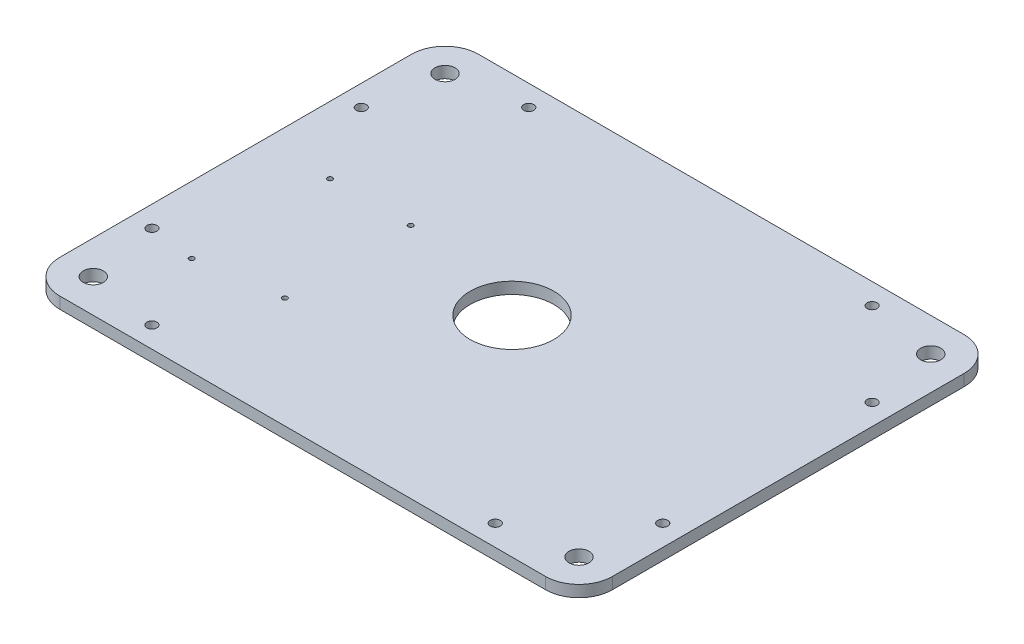
ISO-10303-21;
HEADER;
FILE_DESCRIPTION(('STEP AP214'),'2;1');
FILE_NAME('part.step','',(''),(''),'','','');
FILE_SCHEMA(('AUTOMOTIVE_DESIGN { 1 0 10303 214 1 1 1 1 }'));
ENDSEC;
DATA;
#1=APPLICATION_CONTEXT('core data for automotive mechanical design processes');
#2=APPLICATION_PROTOCOL_DEFINITION('international standard','automotive_design',2000,#1);
#3=PRODUCT_CONTEXT('',#1,'mechanical');
#4=PRODUCT('Part','Part','',(#3));
#5=PRODUCT_RELATED_PRODUCT_CATEGORY('part','',(#4));
#6=PRODUCT_DEFINITION_FORMATION('','',#4);
#7=PRODUCT_DEFINITION_CONTEXT('part definition',#1,'design');
#8=PRODUCT_DEFINITION('design','',#6,#7);
#9=PRODUCT_DEFINITION_SHAPE('','',#8);
#10=(LENGTH_UNIT() NAMED_UNIT(*) SI_UNIT(.MILLI.,.METRE.));
#11=(NAMED_UNIT(*) PLANE_ANGLE_UNIT() SI_UNIT($,.RADIAN.));
#12=(NAMED_UNIT(*) SI_UNIT($,.STERADIAN.) SOLID_ANGLE_UNIT());
#13=UNCERTAINTY_MEASURE_WITH_UNIT(LENGTH_MEASURE(1.E-05),#10,'distance_accuracy_value','');
#14=(GEOMETRIC_REPRESENTATION_CONTEXT(3) GLOBAL_UNCERTAINTY_ASSIGNED_CONTEXT((#13)) GLOBAL_UNIT_ASSIGNED_CONTEXT((#10,
#11,#12)) REPRESENTATION_CONTEXT('',''));
#15=CARTESIAN_POINT('',(0.,0.,0.));
#16=DIRECTION('',(0.,0.,1.));
#17=DIRECTION('',(1.,0.,0.));
#18=AXIS2_PLACEMENT_3D('',#15,#16,#17);
#19=CARTESIAN_POINT('',(-165.,6.9,125.));
#20=DIRECTION('',(1.,0.,0.));
#21=DIRECTION('',(0.,0.,-1.));
#22=AXIS2_PLACEMENT_3D('',#19,#20,#21);
#23=PLANE('',#22);
#24=DIRECTION('',(0.,0.,1.));
#25=VECTOR('',#24,1.);
#26=CARTESIAN_POINT('',(-165.,6.9,125.));
#27=LINE('',#26,#25);
#28=CARTESIAN_POINT('',(-165.,6.9,-105.));
#29=VERTEX_POINT('',#28);
#30=CARTESIAN_POINT('',(-165.,6.9,105.));
#31=VERTEX_POINT('',#30);
#32=EDGE_CURVE('E129',#29,#31,#27,.T.);
#33=ORIENTED_EDGE('',*,*,#32,.F.);
#34=DIRECTION('',(0.,-1.,0.));
#35=VECTOR('',#34,1.);
#36=CARTESIAN_POINT('',(-165.,6.9,-105.));
#37=LINE('',#36,#35);
#38=CARTESIAN_POINT('',(-165.,0.,-105.));
#39=VERTEX_POINT('',#38);
#40=EDGE_CURVE('E155',#29,#39,#37,.T.);
#41=ORIENTED_EDGE('',*,*,#40,.T.);
#42=DIRECTION('',(0.,0.,1.));
#43=VECTOR('',#42,1.);
#44=CARTESIAN_POINT('',(-165.,0.,125.));
#45=LINE('',#44,#43);
#46=CARTESIAN_POINT('',(-165.,0.,105.));
#47=VERTEX_POINT('',#46);
#48=EDGE_CURVE('E161',#39,#47,#45,.T.);
#49=ORIENTED_EDGE('',*,*,#48,.T.);
#50=DIRECTION('',(0.,-1.,0.));
#51=VECTOR('',#50,1.);
#52=CARTESIAN_POINT('',(-165.,6.9,105.));
#53=LINE('',#52,#51);
#54=EDGE_CURVE('E153',#47,#31,#53,.F.);
#55=ORIENTED_EDGE('',*,*,#54,.T.);
#56=EDGE_LOOP('',(#33,#41,#49,#55));
#57=FACE_BOUND('',#56,.T.);
#58=ADVANCED_FACE('F37',(#57),#23,.F.);
#59=CARTESIAN_POINT('',(-165.,6.9,125.));
#60=DIRECTION('',(0.,0.,-1.));
#61=DIRECTION('',(-1.,0.,0.));
#62=AXIS2_PLACEMENT_3D('',#59,#60,#61);
#63=PLANE('',#62);
#64=DIRECTION('',(1.,0.,0.));
#65=VECTOR('',#64,1.);
#66=CARTESIAN_POINT('',(-165.,6.9,125.));
#67=LINE('',#66,#65);
#68=CARTESIAN_POINT('',(-145.,6.9,125.));
#69=VERTEX_POINT('',#68);
#70=CARTESIAN_POINT('',(145.,6.9,125.));
#71=VERTEX_POINT('',#70);
#72=EDGE_CURVE('E132',#69,#71,#67,.T.);
#73=ORIENTED_EDGE('',*,*,#72,.F.);
#74=DIRECTION('',(0.,-1.,0.));
#75=VECTOR('',#74,1.);
#76=CARTESIAN_POINT('',(-145.,6.9,125.));
#77=LINE('',#76,#75);
#78=CARTESIAN_POINT('',(-145.,0.,125.));
#79=VERTEX_POINT('',#78);
#80=EDGE_CURVE('E11',#69,#79,#77,.T.);
#81=ORIENTED_EDGE('',*,*,#80,.T.);
#82=DIRECTION('',(1.,0.,0.));
#83=VECTOR('',#82,1.);
#84=CARTESIAN_POINT('',(-165.,0.,125.));
#85=LINE('',#84,#83);
#86=CARTESIAN_POINT('',(145.,0.,125.));
#87=VERTEX_POINT('',#86);
#88=EDGE_CURVE('E134',#79,#87,#85,.T.);
#89=ORIENTED_EDGE('',*,*,#88,.T.);
#90=DIRECTION('',(0.,-1.,0.));
#91=VECTOR('',#90,1.);
#92=CARTESIAN_POINT('',(145.,6.9,125.));
#93=LINE('',#92,#91);
#94=EDGE_CURVE('E45',#87,#71,#93,.F.);
#95=ORIENTED_EDGE('',*,*,#94,.T.);
#96=EDGE_LOOP('',(#73,#81,#89,#95));
#97=FACE_BOUND('',#96,.T.);
#98=ADVANCED_FACE('F324',(#97),#63,.F.);
#99=CARTESIAN_POINT('',(165.,6.9,125.));
#100=DIRECTION('',(-1.,0.,0.));
#101=DIRECTION('',(0.,0.,1.));
#102=AXIS2_PLACEMENT_3D('',#99,#100,#101);
#103=PLANE('',#102);
#104=DIRECTION('',(0.,0.,-1.));
#105=VECTOR('',#104,1.);
#106=CARTESIAN_POINT('',(165.,0.,125.));
#107=LINE('',#106,#105);
#108=CARTESIAN_POINT('',(165.,0.,105.));
#109=VERTEX_POINT('',#108);
#110=CARTESIAN_POINT('',(165.,0.,-105.));
#111=VERTEX_POINT('',#110);
#112=EDGE_CURVE('E130',#109,#111,#107,.T.);
#113=ORIENTED_EDGE('',*,*,#112,.T.);
#114=DIRECTION('',(0.,-1.,0.));
#115=VECTOR('',#114,1.);
#116=CARTESIAN_POINT('',(165.,6.9,-105.));
#117=LINE('',#116,#115);
#118=CARTESIAN_POINT('',(165.,6.9,-105.));
#119=VERTEX_POINT('',#118);
#120=EDGE_CURVE('E108',#111,#119,#117,.F.);
#121=ORIENTED_EDGE('',*,*,#120,.T.);
#122=DIRECTION('',(0.,0.,-1.));
#123=VECTOR('',#122,1.);
#124=CARTESIAN_POINT('',(165.,6.9,125.));
#125=LINE('',#124,#123);
#126=CARTESIAN_POINT('',(165.,6.9,105.));
#127=VERTEX_POINT('',#126);
#128=EDGE_CURVE('E173',#127,#119,#125,.T.);
#129=ORIENTED_EDGE('',*,*,#128,.F.);
#130=DIRECTION('',(0.,-1.,0.));
#131=VECTOR('',#130,1.);
#132=CARTESIAN_POINT('',(165.,6.9,105.));
#133=LINE('',#132,#131);
#134=EDGE_CURVE('E113',#127,#109,#133,.T.);
#135=ORIENTED_EDGE('',*,*,#134,.T.);
#136=EDGE_LOOP('',(#113,#121,#129,#135));
#137=FACE_BOUND('',#136,.T.);
#138=ADVANCED_FACE('F322',(#137),#103,.F.);
#139=CARTESIAN_POINT('',(-165.,6.9,-125.));
#140=DIRECTION('',(0.,0.,1.));
#141=DIRECTION('',(1.,0.,0.));
#142=AXIS2_PLACEMENT_3D('',#139,#140,#141);
#143=PLANE('',#142);
#144=DIRECTION('',(-1.,0.,0.));
#145=VECTOR('',#144,1.);
#146=CARTESIAN_POINT('',(-165.,6.9,-125.));
#147=LINE('',#146,#145);
#148=CARTESIAN_POINT('',(145.,6.9,-125.));
#149=VERTEX_POINT('',#148);
#150=CARTESIAN_POINT('',(-145.,6.9,-125.));
#151=VERTEX_POINT('',#150);
#152=EDGE_CURVE('E123',#149,#151,#147,.T.);
#153=ORIENTED_EDGE('',*,*,#152,.F.);
#154=DIRECTION('',(0.,-1.,0.));
#155=VECTOR('',#154,1.);
#156=CARTESIAN_POINT('',(145.,6.9,-125.));
#157=LINE('',#156,#155);
#158=CARTESIAN_POINT('',(145.,0.,-125.));
#159=VERTEX_POINT('',#158);
#160=EDGE_CURVE('E107',#149,#159,#157,.T.);
#161=ORIENTED_EDGE('',*,*,#160,.T.);
#162=DIRECTION('',(-1.,0.,0.));
#163=VECTOR('',#162,1.);
#164=CARTESIAN_POINT('',(-165.,0.,-125.));
#165=LINE('',#164,#163);
#166=CARTESIAN_POINT('',(-145.,0.,-125.));
#167=VERTEX_POINT('',#166);
#168=EDGE_CURVE('E120',#159,#167,#165,.T.);
#169=ORIENTED_EDGE('',*,*,#168,.T.);
#170=DIRECTION('',(0.,-1.,0.));
#171=VECTOR('',#170,1.);
#172=CARTESIAN_POINT('',(-145.,6.9,-125.));
#173=LINE('',#172,#171);
#174=EDGE_CURVE('E125',#167,#151,#173,.F.);
#175=ORIENTED_EDGE('',*,*,#174,.T.);
#176=EDGE_LOOP('',(#153,#161,#169,#175));
#177=FACE_BOUND('',#176,.T.);
#178=ADVANCED_FACE('F119',(#177),#143,.F.);
#179=CARTESIAN_POINT('',(0.,6.9,0.));
#180=DIRECTION('',(0.,-1.,0.));
#181=DIRECTION('',(0.,0.,-1.));
#182=AXIS2_PLACEMENT_3D('',#179,#180,#181);
#183=PLANE('',#182);
#184=CARTESIAN_POINT('',(-76.74,6.9,-16.275));
#185=DIRECTION('',(0.,1.,0.));
#186=DIRECTION('',(0.,0.,1.));
#187=AXIS2_PLACEMENT_3D('',#184,#185,#186);
#188=CIRCLE('',#187,1.5);
#189=CARTESIAN_POINT('',(-76.74,6.9,-14.775));
#190=VERTEX_POINT('',#189);
#191=EDGE_CURVE('E265',#190,#190,#188,.T.);
#192=ORIENTED_EDGE('',*,*,#191,.F.);
#193=EDGE_LOOP('',(#192));
#194=FACE_BOUND('',#193,.T.);
#195=CARTESIAN_POINT('',(-125.,6.9,66.275));
#196=DIRECTION('',(0.,1.,0.));
#197=DIRECTION('',(0.,0.,1.));
#198=AXIS2_PLACEMENT_3D('',#195,#196,#197);
#199=CIRCLE('',#198,1.5);
#200=CARTESIAN_POINT('',(-125.,6.9,67.775));
#201=VERTEX_POINT('',#200);
#202=EDGE_CURVE('E258',#201,#201,#199,.T.);
#203=ORIENTED_EDGE('',*,*,#202,.F.);
#204=EDGE_LOOP('',(#203));
#205=FACE_BOUND('',#204,.T.);
#206=CARTESIAN_POINT('',(-76.74,6.9,58.909));
#207=DIRECTION('',(0.,1.,0.));
#208=DIRECTION('',(0.,0.,1.));
#209=AXIS2_PLACEMENT_3D('',#206,#207,#208);
#210=CIRCLE('',#209,1.5);
#211=CARTESIAN_POINT('',(-76.74,6.9,60.409));
#212=VERTEX_POINT('',#211);
#213=EDGE_CURVE('E270',#212,#212,#210,.T.);
#214=ORIENTED_EDGE('',*,*,#213,.F.);
#215=EDGE_LOOP('',(#214));
#216=FACE_BOUND('',#215,.T.);
#217=CARTESIAN_POINT('',(-125.,6.9,-16.275));
#218=DIRECTION('',(0.,1.,0.));
#219=DIRECTION('',(0.,0.,1.));
#220=AXIS2_PLACEMENT_3D('',#217,#218,#219);
#221=CIRCLE('',#220,1.5);
#222=CARTESIAN_POINT('',(-125.,6.9,-14.775));
#223=VERTEX_POINT('',#222);
#224=EDGE_CURVE('E252',#223,#223,#221,.T.);
#225=ORIENTED_EDGE('',*,*,#224,.F.);
#226=EDGE_LOOP('',(#225));
#227=FACE_BOUND('',#226,.T.);
#228=CARTESIAN_POINT('',(152.5,6.9,-62.5));
#229=DIRECTION('',(0.,1.,0.));
#230=DIRECTION('',(0.,0.,1.));
#231=AXIS2_PLACEMENT_3D('',#228,#229,#230);
#232=CIRCLE('',#231,2.99999999999999);
#233=CARTESIAN_POINT('',(152.5,6.9,-59.5));
#234=VERTEX_POINT('',#233);
#235=EDGE_CURVE('E222',#234,#234,#232,.T.);
#236=ORIENTED_EDGE('',*,*,#235,.F.);
#237=EDGE_LOOP('',(#236));
#238=FACE_BOUND('',#237,.T.);
#239=CARTESIAN_POINT('',(-152.5,6.9,-62.5));
#240=DIRECTION('',(0.,1.,0.));
#241=DIRECTION('',(0.,0.,-1.));
#242=AXIS2_PLACEMENT_3D('',#239,#240,#241);
#243=CIRCLE('',#242,2.99999999999999);
#244=CARTESIAN_POINT('',(-152.5,6.9,-65.4999999999999));
#245=VERTEX_POINT('',#244);
#246=EDGE_CURVE('E229',#245,#245,#243,.T.);
#247=ORIENTED_EDGE('',*,*,#246,.F.);
#248=EDGE_LOOP('',(#247));
#249=FACE_BOUND('',#248,.T.);
#250=CARTESIAN_POINT('',(-102.5,6.9,-112.5));
#251=DIRECTION('',(0.,1.,0.));
#252=DIRECTION('',(0.,0.,-1.));
#253=AXIS2_PLACEMENT_3D('',#250,#251,#252);
#254=CIRCLE('',#253,3.00000000000001);
#255=CARTESIAN_POINT('',(-102.5,6.9,-115.5));
#256=VERTEX_POINT('',#255);
#257=EDGE_CURVE('E210',#256,#256,#254,.T.);
#258=ORIENTED_EDGE('',*,*,#257,.F.);
#259=EDGE_LOOP('',(#258));
#260=FACE_BOUND('',#259,.T.);
#261=CARTESIAN_POINT('',(-102.5,6.9,112.5));
#262=DIRECTION('',(0.,1.,0.));
#263=DIRECTION('',(0.,0.,1.));
#264=AXIS2_PLACEMENT_3D('',#261,#262,#263);
#265=CIRCLE('',#264,3.00000000000001);
#266=CARTESIAN_POINT('',(-102.5,6.9,115.5));
#267=VERTEX_POINT('',#266);
#268=EDGE_CURVE('E217',#267,#267,#265,.T.);
#269=ORIENTED_EDGE('',*,*,#268,.F.);
#270=EDGE_LOOP('',(#269));
#271=FACE_BOUND('',#270,.T.);
#272=CARTESIAN_POINT('',(102.5,6.9,-112.5));
#273=DIRECTION('',(0.,1.,0.));
#274=DIRECTION('',(0.,0.,1.));
#275=AXIS2_PLACEMENT_3D('',#272,#273,#274);
#276=CIRCLE('',#275,3.00000000000001);
#277=CARTESIAN_POINT('',(102.5,6.9,-109.5));
#278=VERTEX_POINT('',#277);
#279=EDGE_CURVE('E247',#278,#278,#276,.T.);
#280=ORIENTED_EDGE('',*,*,#279,.F.);
#281=EDGE_LOOP('',(#280));
#282=FACE_BOUND('',#281,.T.);
#283=CARTESIAN_POINT('',(102.5,6.9,112.5));
#284=DIRECTION('',(0.,1.,0.));
#285=DIRECTION('',(0.,0.,-1.));
#286=AXIS2_PLACEMENT_3D('',#283,#284,#285);
#287=CIRCLE('',#286,3.00000000000001);
#288=CARTESIAN_POINT('',(102.5,6.9,109.5));
#289=VERTEX_POINT('',#288);
#290=EDGE_CURVE('E241',#289,#289,#287,.T.);
#291=ORIENTED_EDGE('',*,*,#290,.F.);
#292=EDGE_LOOP('',(#291));
#293=FACE_BOUND('',#292,.T.);
#294=CARTESIAN_POINT('',(152.5,6.9,62.5));
#295=DIRECTION('',(0.,1.,0.));
#296=DIRECTION('',(0.,0.,-1.));
#297=AXIS2_PLACEMENT_3D('',#294,#295,#296);
#298=CIRCLE('',#297,2.99999999999999);
#299=CARTESIAN_POINT('',(152.5,6.9,59.5));
#300=VERTEX_POINT('',#299);
#301=EDGE_CURVE('E234',#300,#300,#298,.T.);
#302=ORIENTED_EDGE('',*,*,#301,.F.);
#303=EDGE_LOOP('',(#302));
#304=FACE_BOUND('',#303,.T.);
#305=CARTESIAN_POINT('',(-152.5,6.9,62.5));
#306=DIRECTION('',(0.,1.,0.));
#307=DIRECTION('',(0.,0.,1.));
#308=AXIS2_PLACEMENT_3D('',#305,#306,#307);
#309=CIRCLE('',#308,2.99999999999999);
#310=CARTESIAN_POINT('',(-152.5,6.9,65.4999999999999));
#311=VERTEX_POINT('',#310);
#312=EDGE_CURVE('E204',#311,#311,#309,.T.);
#313=ORIENTED_EDGE('',*,*,#312,.F.);
#314=EDGE_LOOP('',(#313));
#315=FACE_BOUND('',#314,.T.);
#316=CARTESIAN_POINT('',(0.,6.9,0.));
#317=DIRECTION('',(0.,1.,0.));
#318=DIRECTION('',(0.,0.,1.));
#319=AXIS2_PLACEMENT_3D('',#316,#317,#318);
#320=CIRCLE('',#319,25.);
#321=CARTESIAN_POINT('',(0.,6.9,25.));
#322=VERTEX_POINT('',#321);
#323=EDGE_CURVE('E198',#322,#322,#320,.T.);
#324=ORIENTED_EDGE('',*,*,#323,.F.);
#325=EDGE_LOOP('',(#324));
#326=FACE_BOUND('',#325,.T.);
#327=CARTESIAN_POINT('',(-145.,6.9,105.));
#328=DIRECTION('',(0.,1.,0.));
#329=DIRECTION('',(0.,0.,1.));
#330=AXIS2_PLACEMENT_3D('',#327,#328,#329);
#331=CIRCLE('',#330,6.00000000000002);
#332=CARTESIAN_POINT('',(-145.,6.9,111.));
#333=VERTEX_POINT('',#332);
#334=EDGE_CURVE('E180',#333,#333,#331,.T.);
#335=ORIENTED_EDGE('',*,*,#334,.F.);
#336=EDGE_LOOP('',(#335));
#337=FACE_BOUND('',#336,.T.);
#338=CARTESIAN_POINT('',(145.,6.9,105.));
#339=DIRECTION('',(0.,1.,0.));
#340=DIRECTION('',(0.,0.,1.));
#341=AXIS2_PLACEMENT_3D('',#338,#339,#340);
#342=CIRCLE('',#341,6.00000000000002);
#343=CARTESIAN_POINT('',(145.,6.9,111.));
#344=VERTEX_POINT('',#343);
#345=EDGE_CURVE('E187',#344,#344,#342,.T.);
#346=ORIENTED_EDGE('',*,*,#345,.F.);
#347=EDGE_LOOP('',(#346));
#348=FACE_BOUND('',#347,.T.);
#349=CARTESIAN_POINT('',(145.,6.9,-105.));
#350=DIRECTION('',(0.,1.,0.));
#351=DIRECTION('',(0.,0.,1.));
#352=AXIS2_PLACEMENT_3D('',#349,#350,#351);
#353=CIRCLE('',#352,6.00000000000002);
#354=CARTESIAN_POINT('',(145.,6.9,-99.));
#355=VERTEX_POINT('',#354);
#356=EDGE_CURVE('E193',#355,#355,#353,.T.);
#357=ORIENTED_EDGE('',*,*,#356,.F.);
#358=EDGE_LOOP('',(#357));
#359=FACE_BOUND('',#358,.T.);
#360=CARTESIAN_POINT('',(-145.,6.9,-105.));
#361=DIRECTION('',(0.,1.,0.));
#362=DIRECTION('',(0.,0.,1.));
#363=AXIS2_PLACEMENT_3D('',#360,#361,#362);
#364=CIRCLE('',#363,6.00000000000002);
#365=CARTESIAN_POINT('',(-145.,6.9,-99.));
#366=VERTEX_POINT('',#365);
#367=EDGE_CURVE('E169',#366,#366,#364,.T.);
#368=ORIENTED_EDGE('',*,*,#367,.F.);
#369=EDGE_LOOP('',(#368));
#370=FACE_BOUND('',#369,.T.);
#371=ORIENTED_EDGE('',*,*,#128,.T.);
#372=CARTESIAN_POINT('',(145.,6.9,-105.));
#373=DIRECTION('',(0.,-1.,0.));
#374=DIRECTION('',(0.,0.,-1.));
#375=AXIS2_PLACEMENT_3D('',#372,#373,#374);
#376=CIRCLE('',#375,20.);
#377=EDGE_CURVE('E151',#119,#149,#376,.F.);
#378=ORIENTED_EDGE('',*,*,#377,.T.);
#379=ORIENTED_EDGE('',*,*,#152,.T.);
#380=CARTESIAN_POINT('',(-145.,6.9,-105.));
#381=DIRECTION('',(0.,-1.,0.));
#382=DIRECTION('',(0.,0.,-1.));
#383=AXIS2_PLACEMENT_3D('',#380,#381,#382);
#384=CIRCLE('',#383,20.);
#385=EDGE_CURVE('E149',#151,#29,#384,.F.);
#386=ORIENTED_EDGE('',*,*,#385,.T.);
#387=ORIENTED_EDGE('',*,*,#32,.T.);
#388=CARTESIAN_POINT('',(-145.,6.9,105.));
#389=DIRECTION('',(0.,-1.,0.));
#390=DIRECTION('',(0.,0.,-1.));
#391=AXIS2_PLACEMENT_3D('',#388,#389,#390);
#392=CIRCLE('',#391,20.);
#393=EDGE_CURVE('E58',#31,#69,#392,.F.);
#394=ORIENTED_EDGE('',*,*,#393,.T.);
#395=ORIENTED_EDGE('',*,*,#72,.T.);
#396=CARTESIAN_POINT('',(145.,6.9,105.));
#397=DIRECTION('',(0.,-1.,0.));
#398=DIRECTION('',(0.,0.,-1.));
#399=AXIS2_PLACEMENT_3D('',#396,#397,#398);
#400=CIRCLE('',#399,20.);
#401=EDGE_CURVE('E146',#71,#127,#400,.F.);
#402=ORIENTED_EDGE('',*,*,#401,.T.);
#403=EDGE_LOOP('',(#371,#378,#379,#386,#387,#394,#395,#402));
#404=FACE_BOUND('',#403,.T.);
#405=ADVANCED_FACE('F286',(#194,#205,#216,#227,#238,#249,#260,#271,#282,#293,#304,#315,#326,
#337,#348,#359,#370,#404),#183,.F.);
#406=CARTESIAN_POINT('',(0.,0.,0.));
#407=DIRECTION('',(0.,-1.,0.));
#408=DIRECTION('',(0.,0.,-1.));
#409=AXIS2_PLACEMENT_3D('',#406,#407,#408);
#410=PLANE('',#409);
#411=CARTESIAN_POINT('',(-76.74,0.,-16.275));
#412=DIRECTION('',(0.,1.,0.));
#413=DIRECTION('',(0.,0.,1.));
#414=AXIS2_PLACEMENT_3D('',#411,#412,#413);
#415=CIRCLE('',#414,1.5);
#416=CARTESIAN_POINT('',(-76.74,0.,-14.775));
#417=VERTEX_POINT('',#416);
#418=EDGE_CURVE('E255',#417,#417,#415,.T.);
#419=ORIENTED_EDGE('',*,*,#418,.T.);
#420=EDGE_LOOP('',(#419));
#421=FACE_BOUND('',#420,.T.);
#422=CARTESIAN_POINT('',(-125.,0.,66.275));
#423=DIRECTION('',(0.,1.,0.));
#424=DIRECTION('',(0.,0.,1.));
#425=AXIS2_PLACEMENT_3D('',#422,#423,#424);
#426=CIRCLE('',#425,1.5);
#427=CARTESIAN_POINT('',(-125.,0.,67.775));
#428=VERTEX_POINT('',#427);
#429=EDGE_CURVE('E261',#428,#428,#426,.T.);
#430=ORIENTED_EDGE('',*,*,#429,.T.);
#431=EDGE_LOOP('',(#430));
#432=FACE_BOUND('',#431,.T.);
#433=CARTESIAN_POINT('',(-76.74,0.,58.909));
#434=DIRECTION('',(0.,1.,0.));
#435=DIRECTION('',(0.,0.,1.));
#436=AXIS2_PLACEMENT_3D('',#433,#434,#435);
#437=CIRCLE('',#436,1.5);
#438=CARTESIAN_POINT('',(-76.74,0.,60.409));
#439=VERTEX_POINT('',#438);
#440=EDGE_CURVE('E262',#439,#439,#437,.T.);
#441=ORIENTED_EDGE('',*,*,#440,.T.);
#442=EDGE_LOOP('',(#441));
#443=FACE_BOUND('',#442,.T.);
#444=CARTESIAN_POINT('',(-125.,0.,-16.275));
#445=DIRECTION('',(0.,1.,0.));
#446=DIRECTION('',(0.,0.,1.));
#447=AXIS2_PLACEMENT_3D('',#444,#445,#446);
#448=CIRCLE('',#447,1.5);
#449=CARTESIAN_POINT('',(-125.,0.,-14.775));
#450=VERTEX_POINT('',#449);
#451=EDGE_CURVE('E238',#450,#450,#448,.T.);
#452=ORIENTED_EDGE('',*,*,#451,.T.);
#453=EDGE_LOOP('',(#452));
#454=FACE_BOUND('',#453,.T.);
#455=CARTESIAN_POINT('',(152.5,0.,-62.5));
#456=DIRECTION('',(0.,1.,0.));
#457=DIRECTION('',(0.,0.,1.));
#458=AXIS2_PLACEMENT_3D('',#455,#456,#457);
#459=CIRCLE('',#458,2.99999999999999);
#460=CARTESIAN_POINT('',(152.5,0.,-59.5));
#461=VERTEX_POINT('',#460);
#462=EDGE_CURVE('E225',#461,#461,#459,.T.);
#463=ORIENTED_EDGE('',*,*,#462,.T.);
#464=EDGE_LOOP('',(#463));
#465=FACE_BOUND('',#464,.T.);
#466=CARTESIAN_POINT('',(-152.5,0.,-62.5));
#467=DIRECTION('',(0.,1.,0.));
#468=DIRECTION('',(0.,0.,-1.));
#469=AXIS2_PLACEMENT_3D('',#466,#467,#468);
#470=CIRCLE('',#469,2.99999999999999);
#471=CARTESIAN_POINT('',(-152.5,0.,-65.4999999999999));
#472=VERTEX_POINT('',#471);
#473=EDGE_CURVE('E214',#472,#472,#470,.T.);
#474=ORIENTED_EDGE('',*,*,#473,.T.);
#475=EDGE_LOOP('',(#474));
#476=FACE_BOUND('',#475,.T.);
#477=CARTESIAN_POINT('',(-102.5,0.,-112.5));
#478=DIRECTION('',(0.,1.,0.));
#479=DIRECTION('',(0.,0.,-1.));
#480=AXIS2_PLACEMENT_3D('',#477,#478,#479);
#481=CIRCLE('',#480,3.00000000000001);
#482=CARTESIAN_POINT('',(-102.5,0.,-115.5));
#483=VERTEX_POINT('',#482);
#484=EDGE_CURVE('E213',#483,#483,#481,.T.);
#485=ORIENTED_EDGE('',*,*,#484,.T.);
#486=EDGE_LOOP('',(#485));
#487=FACE_BOUND('',#486,.T.);
#488=CARTESIAN_POINT('',(-102.5,0.,112.5));
#489=DIRECTION('',(0.,1.,0.));
#490=DIRECTION('',(0.,0.,1.));
#491=AXIS2_PLACEMENT_3D('',#488,#489,#490);
#492=CIRCLE('',#491,3.00000000000001);
#493=CARTESIAN_POINT('',(-102.5,0.,115.5));
#494=VERTEX_POINT('',#493);
#495=EDGE_CURVE('E207',#494,#494,#492,.T.);
#496=ORIENTED_EDGE('',*,*,#495,.T.);
#497=EDGE_LOOP('',(#496));
#498=FACE_BOUND('',#497,.T.);
#499=CARTESIAN_POINT('',(102.5,0.,-112.5));
#500=DIRECTION('',(0.,1.,0.));
#501=DIRECTION('',(0.,0.,1.));
#502=AXIS2_PLACEMENT_3D('',#499,#500,#501);
#503=CIRCLE('',#502,3.00000000000001);
#504=CARTESIAN_POINT('',(102.5,0.,-109.5));
#505=VERTEX_POINT('',#504);
#506=EDGE_CURVE('E226',#505,#505,#503,.T.);
#507=ORIENTED_EDGE('',*,*,#506,.T.);
#508=EDGE_LOOP('',(#507));
#509=FACE_BOUND('',#508,.T.);
#510=CARTESIAN_POINT('',(102.5,0.,112.5));
#511=DIRECTION('',(0.,1.,0.));
#512=DIRECTION('',(0.,0.,-1.));
#513=AXIS2_PLACEMENT_3D('',#510,#511,#512);
#514=CIRCLE('',#513,3.00000000000001);
#515=CARTESIAN_POINT('',(102.5,0.,109.5));
#516=VERTEX_POINT('',#515);
#517=EDGE_CURVE('E244',#516,#516,#514,.T.);
#518=ORIENTED_EDGE('',*,*,#517,.T.);
#519=EDGE_LOOP('',(#518));
#520=FACE_BOUND('',#519,.T.);
#521=CARTESIAN_POINT('',(152.5,0.,62.5));
#522=DIRECTION('',(0.,1.,0.));
#523=DIRECTION('',(0.,0.,-1.));
#524=AXIS2_PLACEMENT_3D('',#521,#522,#523);
#525=CIRCLE('',#524,2.99999999999999);
#526=CARTESIAN_POINT('',(152.5,0.,59.5));
#527=VERTEX_POINT('',#526);
#528=EDGE_CURVE('E237',#527,#527,#525,.T.);
#529=ORIENTED_EDGE('',*,*,#528,.T.);
#530=EDGE_LOOP('',(#529));
#531=FACE_BOUND('',#530,.T.);
#532=CARTESIAN_POINT('',(-152.5,0.,62.5));
#533=DIRECTION('',(0.,1.,0.));
#534=DIRECTION('',(0.,0.,1.));
#535=AXIS2_PLACEMENT_3D('',#532,#533,#534);
#536=CIRCLE('',#535,2.99999999999999);
#537=CARTESIAN_POINT('',(-152.5,0.,65.4999999999999));
#538=VERTEX_POINT('',#537);
#539=EDGE_CURVE('E201',#538,#538,#536,.T.);
#540=ORIENTED_EDGE('',*,*,#539,.T.);
#541=EDGE_LOOP('',(#540));
#542=FACE_BOUND('',#541,.T.);
#543=CARTESIAN_POINT('',(0.,0.,0.));
#544=DIRECTION('',(0.,1.,0.));
#545=DIRECTION('',(0.,0.,1.));
#546=AXIS2_PLACEMENT_3D('',#543,#544,#545);
#547=CIRCLE('',#546,25.);
#548=CARTESIAN_POINT('',(0.,0.,25.));
#549=VERTEX_POINT('',#548);
#550=EDGE_CURVE('E184',#549,#549,#547,.T.);
#551=ORIENTED_EDGE('',*,*,#550,.T.);
#552=EDGE_LOOP('',(#551));
#553=FACE_BOUND('',#552,.T.);
#554=CARTESIAN_POINT('',(-145.,0.,105.));
#555=DIRECTION('',(0.,1.,0.));
#556=DIRECTION('',(0.,0.,1.));
#557=AXIS2_PLACEMENT_3D('',#554,#555,#556);
#558=CIRCLE('',#557,6.00000000000002);
#559=CARTESIAN_POINT('',(-145.,0.,111.));
#560=VERTEX_POINT('',#559);
#561=EDGE_CURVE('E183',#560,#560,#558,.T.);
#562=ORIENTED_EDGE('',*,*,#561,.T.);
#563=EDGE_LOOP('',(#562));
#564=FACE_BOUND('',#563,.T.);
#565=CARTESIAN_POINT('',(145.,0.,105.));
#566=DIRECTION('',(0.,1.,0.));
#567=DIRECTION('',(0.,0.,1.));
#568=AXIS2_PLACEMENT_3D('',#565,#566,#567);
#569=CIRCLE('',#568,6.00000000000002);
#570=CARTESIAN_POINT('',(145.,0.,111.));
#571=VERTEX_POINT('',#570);
#572=EDGE_CURVE('E190',#571,#571,#569,.T.);
#573=ORIENTED_EDGE('',*,*,#572,.T.);
#574=EDGE_LOOP('',(#573));
#575=FACE_BOUND('',#574,.T.);
#576=CARTESIAN_POINT('',(145.,0.,-105.));
#577=DIRECTION('',(0.,1.,0.));
#578=DIRECTION('',(0.,0.,1.));
#579=AXIS2_PLACEMENT_3D('',#576,#577,#578);
#580=CIRCLE('',#579,6.00000000000002);
#581=CARTESIAN_POINT('',(145.,0.,-99.));
#582=VERTEX_POINT('',#581);
#583=EDGE_CURVE('E178',#582,#582,#580,.T.);
#584=ORIENTED_EDGE('',*,*,#583,.T.);
#585=EDGE_LOOP('',(#584));
#586=FACE_BOUND('',#585,.T.);
#587=CARTESIAN_POINT('',(-145.,0.,-105.));
#588=DIRECTION('',(0.,1.,0.));
#589=DIRECTION('',(0.,0.,1.));
#590=AXIS2_PLACEMENT_3D('',#587,#588,#589);
#591=CIRCLE('',#590,6.00000000000002);
#592=CARTESIAN_POINT('',(-145.,0.,-99.));
#593=VERTEX_POINT('',#592);
#594=EDGE_CURVE('E166',#593,#593,#591,.T.);
#595=ORIENTED_EDGE('',*,*,#594,.T.);
#596=EDGE_LOOP('',(#595));
#597=FACE_BOUND('',#596,.T.);
#598=ORIENTED_EDGE('',*,*,#168,.F.);
#599=CARTESIAN_POINT('',(145.,0.,-105.));
#600=DIRECTION('',(0.,-1.,0.));
#601=DIRECTION('',(0.,0.,-1.));
#602=AXIS2_PLACEMENT_3D('',#599,#600,#601);
#603=CIRCLE('',#602,20.);
#604=EDGE_CURVE('E103',#159,#111,#603,.T.);
#605=ORIENTED_EDGE('',*,*,#604,.T.);
#606=ORIENTED_EDGE('',*,*,#112,.F.);
#607=CARTESIAN_POINT('',(145.,0.,105.));
#608=DIRECTION('',(0.,-1.,0.));
#609=DIRECTION('',(0.,0.,-1.));
#610=AXIS2_PLACEMENT_3D('',#607,#608,#609);
#611=CIRCLE('',#610,20.);
#612=EDGE_CURVE('E124',#109,#87,#611,.T.);
#613=ORIENTED_EDGE('',*,*,#612,.T.);
#614=ORIENTED_EDGE('',*,*,#88,.F.);
#615=CARTESIAN_POINT('',(-145.,0.,105.));
#616=DIRECTION('',(0.,-1.,0.));
#617=DIRECTION('',(0.,0.,-1.));
#618=AXIS2_PLACEMENT_3D('',#615,#616,#617);
#619=CIRCLE('',#618,20.);
#620=EDGE_CURVE('E140',#79,#47,#619,.T.);
#621=ORIENTED_EDGE('',*,*,#620,.T.);
#622=ORIENTED_EDGE('',*,*,#48,.F.);
#623=CARTESIAN_POINT('',(-145.,0.,-105.));
#624=DIRECTION('',(0.,-1.,0.));
#625=DIRECTION('',(0.,0.,-1.));
#626=AXIS2_PLACEMENT_3D('',#623,#624,#625);
#627=CIRCLE('',#626,20.);
#628=EDGE_CURVE('E114',#39,#167,#627,.T.);
#629=ORIENTED_EDGE('',*,*,#628,.T.);
#630=EDGE_LOOP('',(#598,#605,#606,#613,#614,#621,#622,#629));
#631=FACE_BOUND('',#630,.T.);
#632=ADVANCED_FACE('F127',(#421,#432,#443,#454,#465,#476,#487,#498,#509,#520,#531,#542,#553,
#564,#575,#586,#597,#631),#410,.T.);
#633=CARTESIAN_POINT('',(-145.,0.,-105.));
#634=DIRECTION('',(0.,1.,0.));
#635=DIRECTION('',(0.,0.,1.));
#636=AXIS2_PLACEMENT_3D('',#633,#634,#635);
#637=CYLINDRICAL_SURFACE('',#636,6.00000000000002);
#638=ORIENTED_EDGE('',*,*,#594,.F.);
#639=EDGE_LOOP('',(#638));
#640=FACE_BOUND('',#639,.T.);
#641=ORIENTED_EDGE('',*,*,#367,.T.);
#642=EDGE_LOOP('',(#641));
#643=FACE_BOUND('',#642,.T.);
#644=ADVANCED_FACE('F349',(#640,#643),#637,.F.);
#645=CARTESIAN_POINT('',(145.,0.,-105.));
#646=DIRECTION('',(0.,1.,0.));
#647=DIRECTION('',(0.,0.,1.));
#648=AXIS2_PLACEMENT_3D('',#645,#646,#647);
#649=CYLINDRICAL_SURFACE('',#648,6.00000000000002);
#650=ORIENTED_EDGE('',*,*,#583,.F.);
#651=EDGE_LOOP('',(#650));
#652=FACE_BOUND('',#651,.T.);
#653=ORIENTED_EDGE('',*,*,#356,.T.);
#654=EDGE_LOOP('',(#653));
#655=FACE_BOUND('',#654,.T.);
#656=ADVANCED_FACE('F354',(#652,#655),#649,.F.);
#657=CARTESIAN_POINT('',(145.,0.,105.));
#658=DIRECTION('',(0.,1.,0.));
#659=DIRECTION('',(0.,0.,1.));
#660=AXIS2_PLACEMENT_3D('',#657,#658,#659);
#661=CYLINDRICAL_SURFACE('',#660,6.00000000000002);
#662=ORIENTED_EDGE('',*,*,#572,.F.);
#663=EDGE_LOOP('',(#662));
#664=FACE_BOUND('',#663,.T.);
#665=ORIENTED_EDGE('',*,*,#345,.T.);
#666=EDGE_LOOP('',(#665));
#667=FACE_BOUND('',#666,.T.);
#668=ADVANCED_FACE('F360',(#664,#667),#661,.F.);
#669=CARTESIAN_POINT('',(-145.,0.,105.));
#670=DIRECTION('',(0.,1.,0.));
#671=DIRECTION('',(0.,0.,1.));
#672=AXIS2_PLACEMENT_3D('',#669,#670,#671);
#673=CYLINDRICAL_SURFACE('',#672,6.00000000000002);
#674=ORIENTED_EDGE('',*,*,#561,.F.);
#675=EDGE_LOOP('',(#674));
#676=FACE_BOUND('',#675,.T.);
#677=ORIENTED_EDGE('',*,*,#334,.T.);
#678=EDGE_LOOP('',(#677));
#679=FACE_BOUND('',#678,.T.);
#680=ADVANCED_FACE('F356',(#676,#679),#673,.F.);
#681=CARTESIAN_POINT('',(0.,0.,0.));
#682=DIRECTION('',(0.,1.,0.));
#683=DIRECTION('',(0.,0.,1.));
#684=AXIS2_PLACEMENT_3D('',#681,#682,#683);
#685=CYLINDRICAL_SURFACE('',#684,25.);
#686=ORIENTED_EDGE('',*,*,#550,.F.);
#687=EDGE_LOOP('',(#686));
#688=FACE_BOUND('',#687,.T.);
#689=ORIENTED_EDGE('',*,*,#323,.T.);
#690=EDGE_LOOP('',(#689));
#691=FACE_BOUND('',#690,.T.);
#692=ADVANCED_FACE('F359',(#688,#691),#685,.F.);
#693=CARTESIAN_POINT('',(-152.5,0.,62.5));
#694=DIRECTION('',(0.,1.,0.));
#695=DIRECTION('',(0.,0.,1.));
#696=AXIS2_PLACEMENT_3D('',#693,#694,#695);
#697=CYLINDRICAL_SURFACE('',#696,2.99999999999999);
#698=ORIENTED_EDGE('',*,*,#539,.F.);
#699=EDGE_LOOP('',(#698));
#700=FACE_BOUND('',#699,.T.);
#701=ORIENTED_EDGE('',*,*,#312,.T.);
#702=EDGE_LOOP('',(#701));
#703=FACE_BOUND('',#702,.T.);
#704=ADVANCED_FACE('F370',(#700,#703),#697,.F.);
#705=CARTESIAN_POINT('',(152.5,0.,62.5));
#706=DIRECTION('',(0.,1.,0.));
#707=DIRECTION('',(0.,0.,1.));
#708=AXIS2_PLACEMENT_3D('',#705,#706,#707);
#709=CYLINDRICAL_SURFACE('',#708,2.99999999999999);
#710=ORIENTED_EDGE('',*,*,#528,.F.);
#711=EDGE_LOOP('',(#710));
#712=FACE_BOUND('',#711,.T.);
#713=ORIENTED_EDGE('',*,*,#301,.T.);
#714=EDGE_LOOP('',(#713));
#715=FACE_BOUND('',#714,.T.);
#716=ADVANCED_FACE('F374',(#712,#715),#709,.F.);
#717=CARTESIAN_POINT('',(102.5,0.,112.5));
#718=DIRECTION('',(0.,1.,0.));
#719=DIRECTION('',(0.,0.,1.));
#720=AXIS2_PLACEMENT_3D('',#717,#718,#719);
#721=CYLINDRICAL_SURFACE('',#720,3.00000000000001);
#722=ORIENTED_EDGE('',*,*,#517,.F.);
#723=EDGE_LOOP('',(#722));
#724=FACE_BOUND('',#723,.T.);
#725=ORIENTED_EDGE('',*,*,#290,.T.);
#726=EDGE_LOOP('',(#725));
#727=FACE_BOUND('',#726,.T.);
#728=ADVANCED_FACE('F394',(#724,#727),#721,.F.);
#729=CARTESIAN_POINT('',(102.5,0.,-112.5));
#730=DIRECTION('',(0.,1.,0.));
#731=DIRECTION('',(0.,0.,1.));
#732=AXIS2_PLACEMENT_3D('',#729,#730,#731);
#733=CYLINDRICAL_SURFACE('',#732,3.00000000000001);
#734=ORIENTED_EDGE('',*,*,#506,.F.);
#735=EDGE_LOOP('',(#734));
#736=FACE_BOUND('',#735,.T.);
#737=ORIENTED_EDGE('',*,*,#279,.T.);
#738=EDGE_LOOP('',(#737));
#739=FACE_BOUND('',#738,.T.);
#740=ADVANCED_FACE('F384',(#736,#739),#733,.F.);
#741=CARTESIAN_POINT('',(-102.5,0.,112.5));
#742=DIRECTION('',(0.,1.,0.));
#743=DIRECTION('',(0.,0.,1.));
#744=AXIS2_PLACEMENT_3D('',#741,#742,#743);
#745=CYLINDRICAL_SURFACE('',#744,3.00000000000001);
#746=ORIENTED_EDGE('',*,*,#495,.F.);
#747=EDGE_LOOP('',(#746));
#748=FACE_BOUND('',#747,.T.);
#749=ORIENTED_EDGE('',*,*,#268,.T.);
#750=EDGE_LOOP('',(#749));
#751=FACE_BOUND('',#750,.T.);
#752=ADVANCED_FACE('F380',(#748,#751),#745,.F.);
#753=CARTESIAN_POINT('',(-102.5,0.,-112.5));
#754=DIRECTION('',(0.,1.,0.));
#755=DIRECTION('',(0.,0.,1.));
#756=AXIS2_PLACEMENT_3D('',#753,#754,#755);
#757=CYLINDRICAL_SURFACE('',#756,3.00000000000001);
#758=ORIENTED_EDGE('',*,*,#484,.F.);
#759=EDGE_LOOP('',(#758));
#760=FACE_BOUND('',#759,.T.);
#761=ORIENTED_EDGE('',*,*,#257,.T.);
#762=EDGE_LOOP('',(#761));
#763=FACE_BOUND('',#762,.T.);
#764=ADVANCED_FACE('F376',(#760,#763),#757,.F.);
#765=CARTESIAN_POINT('',(-152.5,0.,-62.5));
#766=DIRECTION('',(0.,1.,0.));
#767=DIRECTION('',(0.,0.,1.));
#768=AXIS2_PLACEMENT_3D('',#765,#766,#767);
#769=CYLINDRICAL_SURFACE('',#768,2.99999999999999);
#770=ORIENTED_EDGE('',*,*,#473,.F.);
#771=EDGE_LOOP('',(#770));
#772=FACE_BOUND('',#771,.T.);
#773=ORIENTED_EDGE('',*,*,#246,.T.);
#774=EDGE_LOOP('',(#773));
#775=FACE_BOUND('',#774,.T.);
#776=ADVANCED_FACE('F379',(#772,#775),#769,.F.);
#777=CARTESIAN_POINT('',(152.5,0.,-62.5));
#778=DIRECTION('',(0.,1.,0.));
#779=DIRECTION('',(0.,0.,1.));
#780=AXIS2_PLACEMENT_3D('',#777,#778,#779);
#781=CYLINDRICAL_SURFACE('',#780,2.99999999999999);
#782=ORIENTED_EDGE('',*,*,#462,.F.);
#783=EDGE_LOOP('',(#782));
#784=FACE_BOUND('',#783,.T.);
#785=ORIENTED_EDGE('',*,*,#235,.T.);
#786=EDGE_LOOP('',(#785));
#787=FACE_BOUND('',#786,.T.);
#788=ADVANCED_FACE('F335',(#784,#787),#781,.F.);
#789=CARTESIAN_POINT('',(145.,6.9,-105.));
#790=DIRECTION('',(0.,-1.,0.));
#791=DIRECTION('',(0.,0.,-1.));
#792=AXIS2_PLACEMENT_3D('',#789,#790,#791);
#793=CYLINDRICAL_SURFACE('',#792,20.);
#794=ORIENTED_EDGE('',*,*,#377,.F.);
#795=ORIENTED_EDGE('',*,*,#120,.F.);
#796=ORIENTED_EDGE('',*,*,#604,.F.);
#797=ORIENTED_EDGE('',*,*,#160,.F.);
#798=EDGE_LOOP('',(#794,#795,#796,#797));
#799=FACE_BOUND('',#798,.T.);
#800=ADVANCED_FACE('F106',(#799),#793,.T.);
#801=CARTESIAN_POINT('',(-145.,6.9,-105.));
#802=DIRECTION('',(0.,-1.,0.));
#803=DIRECTION('',(0.,0.,-1.));
#804=AXIS2_PLACEMENT_3D('',#801,#802,#803);
#805=CYLINDRICAL_SURFACE('',#804,20.);
#806=ORIENTED_EDGE('',*,*,#385,.F.);
#807=ORIENTED_EDGE('',*,*,#174,.F.);
#808=ORIENTED_EDGE('',*,*,#628,.F.);
#809=ORIENTED_EDGE('',*,*,#40,.F.);
#810=EDGE_LOOP('',(#806,#807,#808,#809));
#811=FACE_BOUND('',#810,.T.);
#812=ADVANCED_FACE('F328',(#811),#805,.T.);
#813=CARTESIAN_POINT('',(-145.,6.9,105.));
#814=DIRECTION('',(0.,-1.,0.));
#815=DIRECTION('',(0.,0.,-1.));
#816=AXIS2_PLACEMENT_3D('',#813,#814,#815);
#817=CYLINDRICAL_SURFACE('',#816,20.);
#818=ORIENTED_EDGE('',*,*,#393,.F.);
#819=ORIENTED_EDGE('',*,*,#54,.F.);
#820=ORIENTED_EDGE('',*,*,#620,.F.);
#821=ORIENTED_EDGE('',*,*,#80,.F.);
#822=EDGE_LOOP('',(#818,#819,#820,#821));
#823=FACE_BOUND('',#822,.T.);
#824=ADVANCED_FACE('F327',(#823),#817,.T.);
#825=CARTESIAN_POINT('',(145.,6.9,105.));
#826=DIRECTION('',(0.,-1.,0.));
#827=DIRECTION('',(0.,0.,-1.));
#828=AXIS2_PLACEMENT_3D('',#825,#826,#827);
#829=CYLINDRICAL_SURFACE('',#828,20.);
#830=ORIENTED_EDGE('',*,*,#401,.F.);
#831=ORIENTED_EDGE('',*,*,#94,.F.);
#832=ORIENTED_EDGE('',*,*,#612,.F.);
#833=ORIENTED_EDGE('',*,*,#134,.F.);
#834=EDGE_LOOP('',(#830,#831,#832,#833));
#835=FACE_BOUND('',#834,.T.);
#836=ADVANCED_FACE('F39',(#835),#829,.T.);
#837=CARTESIAN_POINT('',(-125.,0.,-16.275));
#838=DIRECTION('',(0.,1.,0.));
#839=DIRECTION('',(0.,0.,1.));
#840=AXIS2_PLACEMENT_3D('',#837,#838,#839);
#841=CYLINDRICAL_SURFACE('',#840,1.5);
#842=ORIENTED_EDGE('',*,*,#451,.F.);
#843=EDGE_LOOP('',(#842));
#844=FACE_BOUND('',#843,.T.);
#845=ORIENTED_EDGE('',*,*,#224,.T.);
#846=EDGE_LOOP('',(#845));
#847=FACE_BOUND('',#846,.T.);
#848=ADVANCED_FACE('F282',(#844,#847),#841,.F.);
#849=CARTESIAN_POINT('',(-76.74,0.,58.909));
#850=DIRECTION('',(0.,1.,0.));
#851=DIRECTION('',(0.,0.,1.));
#852=AXIS2_PLACEMENT_3D('',#849,#850,#851);
#853=CYLINDRICAL_SURFACE('',#852,1.5);
#854=ORIENTED_EDGE('',*,*,#440,.F.);
#855=EDGE_LOOP('',(#854));
#856=FACE_BOUND('',#855,.T.);
#857=ORIENTED_EDGE('',*,*,#213,.T.);
#858=EDGE_LOOP('',(#857));
#859=FACE_BOUND('',#858,.T.);
#860=ADVANCED_FACE('F278',(#856,#859),#853,.F.);
#861=CARTESIAN_POINT('',(-125.,0.,66.275));
#862=DIRECTION('',(0.,1.,0.));
#863=DIRECTION('',(0.,0.,1.));
#864=AXIS2_PLACEMENT_3D('',#861,#862,#863);
#865=CYLINDRICAL_SURFACE('',#864,1.5);
#866=ORIENTED_EDGE('',*,*,#429,.F.);
#867=EDGE_LOOP('',(#866));
#868=FACE_BOUND('',#867,.T.);
#869=ORIENTED_EDGE('',*,*,#202,.T.);
#870=EDGE_LOOP('',(#869));
#871=FACE_BOUND('',#870,.T.);
#872=ADVANCED_FACE('F281',(#868,#871),#865,.F.);
#873=CARTESIAN_POINT('',(-76.74,0.,-16.275));
#874=DIRECTION('',(0.,1.,0.));
#875=DIRECTION('',(0.,0.,1.));
#876=AXIS2_PLACEMENT_3D('',#873,#874,#875);
#877=CYLINDRICAL_SURFACE('',#876,1.5);
#878=ORIENTED_EDGE('',*,*,#418,.F.);
#879=EDGE_LOOP('',(#878));
#880=FACE_BOUND('',#879,.T.);
#881=ORIENTED_EDGE('',*,*,#191,.T.);
#882=EDGE_LOOP('',(#881));
#883=FACE_BOUND('',#882,.T.);
#884=ADVANCED_FACE('F407',(#880,#883),#877,.F.);
#885=CLOSED_SHELL('',(#58,#98,#138,#178,#405,#632,#644,#656,#668,#680,#692,#704,#716,#728,#740,
#752,#764,#776,#788,#800,#812,#824,#836,#848,#860,#872,#884));
#886=MANIFOLD_SOLID_BREP('B2',#885);
#887=ADVANCED_BREP_SHAPE_REPRESENTATION('',(#18,#886),#14);
#888=SHAPE_DEFINITION_REPRESENTATION(#9,#887);
ENDSEC;
END-ISO-10303-21;
